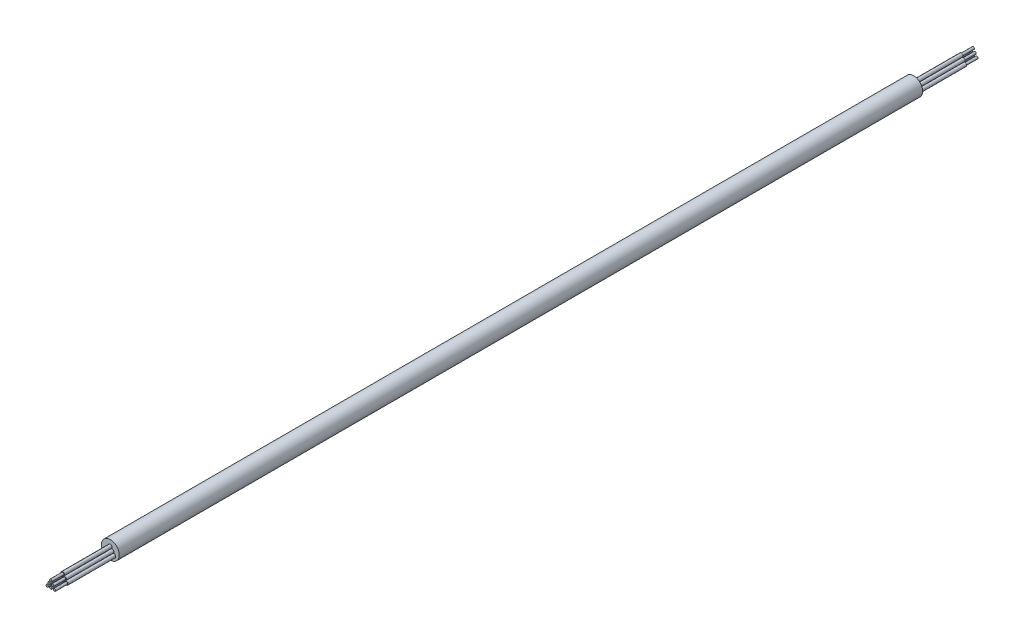
ISO-10303-21;
HEADER;
FILE_DESCRIPTION(('STEP AP214'),'2;1');
FILE_NAME('part.step','',(''),(''),'','','');
FILE_SCHEMA(('AUTOMOTIVE_DESIGN { 1 0 10303 214 1 1 1 1 }'));
ENDSEC;
DATA;
#1=APPLICATION_CONTEXT('core data for automotive mechanical design processes');
#2=APPLICATION_PROTOCOL_DEFINITION('international standard','automotive_design',2000,#1);
#3=PRODUCT_CONTEXT('',#1,'mechanical');
#4=PRODUCT('Part','Part','',(#3));
#5=PRODUCT_RELATED_PRODUCT_CATEGORY('part','',(#4));
#6=PRODUCT_DEFINITION_FORMATION('','',#4);
#7=PRODUCT_DEFINITION_CONTEXT('part definition',#1,'design');
#8=PRODUCT_DEFINITION('design','',#6,#7);
#9=PRODUCT_DEFINITION_SHAPE('','',#8);
#10=(LENGTH_UNIT() NAMED_UNIT(*) SI_UNIT(.MILLI.,.METRE.));
#11=(NAMED_UNIT(*) PLANE_ANGLE_UNIT() SI_UNIT($,.RADIAN.));
#12=(NAMED_UNIT(*) SI_UNIT($,.STERADIAN.) SOLID_ANGLE_UNIT());
#13=UNCERTAINTY_MEASURE_WITH_UNIT(LENGTH_MEASURE(1.E-05),#10,'distance_accuracy_value','');
#14=(GEOMETRIC_REPRESENTATION_CONTEXT(3) GLOBAL_UNCERTAINTY_ASSIGNED_CONTEXT((#13)) GLOBAL_UNIT_ASSIGNED_CONTEXT((#10,
#11,#12)) REPRESENTATION_CONTEXT('',''));
#15=CARTESIAN_POINT('',(0.,0.,0.));
#16=DIRECTION('',(0.,0.,1.));
#17=DIRECTION('',(1.,0.,0.));
#18=AXIS2_PLACEMENT_3D('',#15,#16,#17);
#19=CARTESIAN_POINT('',(-0.31,0.,-8.));
#20=DIRECTION('',(0.,0.,1.));
#21=DIRECTION('',(1.,0.,0.));
#22=AXIS2_PLACEMENT_3D('',#19,#20,#21);
#23=CYLINDRICAL_SURFACE('',#22,0.3);
#24=CARTESIAN_POINT('',(-0.31,0.,135.));
#25=DIRECTION('',(0.,0.,1.));
#26=DIRECTION('',(1.,0.,0.));
#27=AXIS2_PLACEMENT_3D('',#24,#25,#26);
#28=CIRCLE('',#27,0.3);
#29=CARTESIAN_POINT('',(-0.01,0.,135.));
#30=VERTEX_POINT('',#29);
#31=EDGE_CURVE('E206',#30,#30,#28,.F.);
#32=ORIENTED_EDGE('',*,*,#31,.F.);
#33=EDGE_LOOP('',(#32));
#34=FACE_BOUND('',#33,.T.);
#35=CARTESIAN_POINT('',(-0.31,0.,143.));
#36=DIRECTION('',(0.,0.,1.));
#37=DIRECTION('',(1.,0.,0.));
#38=AXIS2_PLACEMENT_3D('',#35,#36,#37);
#39=CIRCLE('',#38,0.3);
#40=CARTESIAN_POINT('',(-0.01,0.,143.));
#41=VERTEX_POINT('',#40);
#42=EDGE_CURVE('E217',#41,#41,#39,.T.);
#43=ORIENTED_EDGE('',*,*,#42,.F.);
#44=EDGE_LOOP('',(#43));
#45=FACE_BOUND('',#44,.T.);
#46=ADVANCED_FACE('F103',(#34,#45),#23,.T.);
#47=CARTESIAN_POINT('',(-0.31,0.,143.));
#48=DIRECTION('',(0.,0.,1.));
#49=DIRECTION('',(1.,0.,0.));
#50=AXIS2_PLACEMENT_3D('',#47,#48,#49);
#51=PLANE('',#50);
#52=CARTESIAN_POINT('',(-0.31,0.,143.));
#53=DIRECTION('',(0.,0.,1.));
#54=DIRECTION('',(1.,0.,0.));
#55=AXIS2_PLACEMENT_3D('',#52,#53,#54);
#56=CIRCLE('',#55,0.2);
#57=CARTESIAN_POINT('',(-0.11,0.,143.));
#58=VERTEX_POINT('',#57);
#59=EDGE_CURVE('E227',#58,#58,#56,.F.);
#60=ORIENTED_EDGE('',*,*,#59,.T.);
#61=EDGE_LOOP('',(#60));
#62=FACE_BOUND('',#61,.T.);
#63=ORIENTED_EDGE('',*,*,#42,.T.);
#64=EDGE_LOOP('',(#63));
#65=FACE_BOUND('',#64,.T.);
#66=ADVANCED_FACE('F264',(#62,#65),#51,.T.);
#67=CARTESIAN_POINT('',(0.,0.,145.));
#68=DIRECTION('',(0.,0.,1.));
#69=DIRECTION('',(1.,0.,0.));
#70=AXIS2_PLACEMENT_3D('',#67,#68,#69);
#71=PLANE('',#70);
#72=CARTESIAN_POINT('',(-0.31,0.,145.));
#73=DIRECTION('',(0.,0.,1.));
#74=DIRECTION('',(1.,0.,0.));
#75=AXIS2_PLACEMENT_3D('',#72,#73,#74);
#76=CIRCLE('',#75,0.2);
#77=CARTESIAN_POINT('',(-0.11,0.,145.));
#78=VERTEX_POINT('',#77);
#79=EDGE_CURVE('E221',#78,#78,#76,.T.);
#80=ORIENTED_EDGE('',*,*,#79,.T.);
#81=EDGE_LOOP('',(#80));
#82=FACE_BOUND('',#81,.T.);
#83=ADVANCED_FACE('F271',(#82),#71,.T.);
#84=CARTESIAN_POINT('',(-0.31,0.,-10.));
#85=DIRECTION('',(0.,0.,1.));
#86=DIRECTION('',(1.,0.,0.));
#87=AXIS2_PLACEMENT_3D('',#84,#85,#86);
#88=CYLINDRICAL_SURFACE('',#87,0.2);
#89=ORIENTED_EDGE('',*,*,#59,.F.);
#90=EDGE_LOOP('',(#89));
#91=FACE_BOUND('',#90,.T.);
#92=ORIENTED_EDGE('',*,*,#79,.F.);
#93=EDGE_LOOP('',(#92));
#94=FACE_BOUND('',#93,.T.);
#95=ADVANCED_FACE('F105',(#91,#94),#88,.T.);
#96=CARTESIAN_POINT('',(0.,0.,135.));
#97=DIRECTION('',(0.,0.,-1.));
#98=DIRECTION('',(-1.,0.,0.));
#99=AXIS2_PLACEMENT_3D('',#96,#97,#98);
#100=CYLINDRICAL_SURFACE('',#99,1.5);
#101=CARTESIAN_POINT('',(0.,0.,135.));
#102=DIRECTION('',(0.,0.,1.));
#103=DIRECTION('',(1.,0.,0.));
#104=AXIS2_PLACEMENT_3D('',#101,#102,#103);
#105=CIRCLE('',#104,1.5);
#106=CARTESIAN_POINT('',(1.5,0.,135.));
#107=VERTEX_POINT('',#106);
#108=EDGE_CURVE('E207',#107,#107,#105,.T.);
#109=ORIENTED_EDGE('',*,*,#108,.F.);
#110=EDGE_LOOP('',(#109));
#111=FACE_BOUND('',#110,.T.);
#112=CARTESIAN_POINT('',(0.,0.,0.));
#113=DIRECTION('',(0.,0.,1.));
#114=DIRECTION('',(1.,0.,0.));
#115=AXIS2_PLACEMENT_3D('',#112,#113,#114);
#116=CIRCLE('',#115,1.5);
#117=CARTESIAN_POINT('',(1.5,0.,0.));
#118=VERTEX_POINT('',#117);
#119=EDGE_CURVE('E211',#118,#118,#116,.T.);
#120=ORIENTED_EDGE('',*,*,#119,.T.);
#121=EDGE_LOOP('',(#120));
#122=FACE_BOUND('',#121,.T.);
#123=ADVANCED_FACE('F303',(#111,#122),#100,.T.);
#124=CARTESIAN_POINT('',(0.,0.,135.));
#125=DIRECTION('',(0.,0.,1.));
#126=DIRECTION('',(1.,0.,0.));
#127=AXIS2_PLACEMENT_3D('',#124,#125,#126);
#128=PLANE('',#127);
#129=CARTESIAN_POINT('',(0.61,-0.53,135.));
#130=DIRECTION('',(0.,0.,1.));
#131=DIRECTION('',(1.,0.,0.));
#132=AXIS2_PLACEMENT_3D('',#129,#130,#131);
#133=CIRCLE('',#132,0.3);
#134=CARTESIAN_POINT('',(0.91,-0.53,135.));
#135=VERTEX_POINT('',#134);
#136=EDGE_CURVE('E11',#135,#135,#133,.T.);
#137=ORIENTED_EDGE('',*,*,#136,.F.);
#138=EDGE_LOOP('',(#137));
#139=FACE_BOUND('',#138,.T.);
#140=CARTESIAN_POINT('',(-0.61,-0.53,135.));
#141=DIRECTION('',(0.,0.,1.));
#142=DIRECTION('',(1.,0.,0.));
#143=AXIS2_PLACEMENT_3D('',#140,#141,#142);
#144=CIRCLE('',#143,0.3);
#145=CARTESIAN_POINT('',(-0.31,-0.53,135.));
#146=VERTEX_POINT('',#145);
#147=EDGE_CURVE('E111',#146,#146,#144,.T.);
#148=ORIENTED_EDGE('',*,*,#147,.F.);
#149=EDGE_LOOP('',(#148));
#150=FACE_BOUND('',#149,.T.);
#151=CARTESIAN_POINT('',(0.,-0.53,135.));
#152=DIRECTION('',(0.,0.,1.));
#153=DIRECTION('',(1.,0.,0.));
#154=AXIS2_PLACEMENT_3D('',#151,#152,#153);
#155=CIRCLE('',#154,0.3);
#156=CARTESIAN_POINT('',(0.3,-0.53,135.));
#157=VERTEX_POINT('',#156);
#158=EDGE_CURVE('E116',#157,#157,#155,.T.);
#159=ORIENTED_EDGE('',*,*,#158,.F.);
#160=EDGE_LOOP('',(#159));
#161=FACE_BOUND('',#160,.T.);
#162=CARTESIAN_POINT('',(0.31,0.,135.));
#163=DIRECTION('',(0.,0.,1.));
#164=DIRECTION('',(1.,0.,0.));
#165=AXIS2_PLACEMENT_3D('',#162,#163,#164);
#166=CIRCLE('',#165,0.3);
#167=CARTESIAN_POINT('',(0.61,0.,135.));
#168=VERTEX_POINT('',#167);
#169=EDGE_CURVE('E162',#168,#168,#166,.T.);
#170=ORIENTED_EDGE('',*,*,#169,.F.);
#171=EDGE_LOOP('',(#170));
#172=FACE_BOUND('',#171,.T.);
#173=CARTESIAN_POINT('',(0.,0.53,135.));
#174=DIRECTION('',(0.,0.,1.));
#175=DIRECTION('',(1.,0.,0.));
#176=AXIS2_PLACEMENT_3D('',#173,#174,#175);
#177=CIRCLE('',#176,0.3);
#178=CARTESIAN_POINT('',(0.3,0.53,135.));
#179=VERTEX_POINT('',#178);
#180=EDGE_CURVE('E184',#179,#179,#177,.T.);
#181=ORIENTED_EDGE('',*,*,#180,.F.);
#182=EDGE_LOOP('',(#181));
#183=FACE_BOUND('',#182,.T.);
#184=ORIENTED_EDGE('',*,*,#31,.T.);
#185=EDGE_LOOP('',(#184));
#186=FACE_BOUND('',#185,.T.);
#187=ORIENTED_EDGE('',*,*,#108,.T.);
#188=EDGE_LOOP('',(#187));
#189=FACE_BOUND('',#188,.T.);
#190=ADVANCED_FACE('F298',(#139,#150,#161,#172,#183,#186,#189),#128,.T.);
#191=CARTESIAN_POINT('',(0.,0.,0.));
#192=DIRECTION('',(0.,0.,1.));
#193=DIRECTION('',(1.,0.,0.));
#194=AXIS2_PLACEMENT_3D('',#191,#192,#193);
#195=PLANE('',#194);
#196=CARTESIAN_POINT('',(0.61,-0.53,0.));
#197=DIRECTION('',(0.,0.,1.));
#198=DIRECTION('',(1.,0.,0.));
#199=AXIS2_PLACEMENT_3D('',#196,#197,#198);
#200=CIRCLE('',#199,0.3);
#201=CARTESIAN_POINT('',(0.91,-0.53,0.));
#202=VERTEX_POINT('',#201);
#203=EDGE_CURVE('E107',#202,#202,#200,.T.);
#204=ORIENTED_EDGE('',*,*,#203,.T.);
#205=EDGE_LOOP('',(#204));
#206=FACE_BOUND('',#205,.T.);
#207=CARTESIAN_POINT('',(-0.61,-0.53,0.));
#208=DIRECTION('',(0.,0.,1.));
#209=DIRECTION('',(1.,0.,0.));
#210=AXIS2_PLACEMENT_3D('',#207,#208,#209);
#211=CIRCLE('',#210,0.3);
#212=CARTESIAN_POINT('',(-0.31,-0.53,0.));
#213=VERTEX_POINT('',#212);
#214=EDGE_CURVE('E138',#213,#213,#211,.T.);
#215=ORIENTED_EDGE('',*,*,#214,.T.);
#216=EDGE_LOOP('',(#215));
#217=FACE_BOUND('',#216,.T.);
#218=CARTESIAN_POINT('',(0.,-0.53,0.));
#219=DIRECTION('',(0.,0.,1.));
#220=DIRECTION('',(1.,0.,0.));
#221=AXIS2_PLACEMENT_3D('',#218,#219,#220);
#222=CIRCLE('',#221,0.3);
#223=CARTESIAN_POINT('',(0.3,-0.53,0.));
#224=VERTEX_POINT('',#223);
#225=EDGE_CURVE('E157',#224,#224,#222,.T.);
#226=ORIENTED_EDGE('',*,*,#225,.T.);
#227=EDGE_LOOP('',(#226));
#228=FACE_BOUND('',#227,.T.);
#229=CARTESIAN_POINT('',(0.31,0.,0.));
#230=DIRECTION('',(0.,0.,1.));
#231=DIRECTION('',(1.,0.,0.));
#232=AXIS2_PLACEMENT_3D('',#229,#230,#231);
#233=CIRCLE('',#232,0.3);
#234=CARTESIAN_POINT('',(0.61,0.,0.));
#235=VERTEX_POINT('',#234);
#236=EDGE_CURVE('E179',#235,#235,#233,.T.);
#237=ORIENTED_EDGE('',*,*,#236,.T.);
#238=EDGE_LOOP('',(#237));
#239=FACE_BOUND('',#238,.T.);
#240=CARTESIAN_POINT('',(0.,0.53,0.));
#241=DIRECTION('',(0.,0.,1.));
#242=DIRECTION('',(1.,0.,0.));
#243=AXIS2_PLACEMENT_3D('',#240,#241,#242);
#244=CIRCLE('',#243,0.3);
#245=CARTESIAN_POINT('',(0.3,0.53,0.));
#246=VERTEX_POINT('',#245);
#247=EDGE_CURVE('E201',#246,#246,#244,.T.);
#248=ORIENTED_EDGE('',*,*,#247,.T.);
#249=EDGE_LOOP('',(#248));
#250=FACE_BOUND('',#249,.T.);
#251=CARTESIAN_POINT('',(-0.31,0.,0.));
#252=DIRECTION('',(0.,0.,1.));
#253=DIRECTION('',(1.,0.,0.));
#254=AXIS2_PLACEMENT_3D('',#251,#252,#253);
#255=CIRCLE('',#254,0.3);
#256=CARTESIAN_POINT('',(-0.01,0.,0.));
#257=VERTEX_POINT('',#256);
#258=EDGE_CURVE('E210',#257,#257,#255,.F.);
#259=ORIENTED_EDGE('',*,*,#258,.F.);
#260=EDGE_LOOP('',(#259));
#261=FACE_BOUND('',#260,.T.);
#262=ORIENTED_EDGE('',*,*,#119,.F.);
#263=EDGE_LOOP('',(#262));
#264=FACE_BOUND('',#263,.T.);
#265=ADVANCED_FACE('F244',(#206,#217,#228,#239,#250,#261,#264),#195,.F.);
#266=CARTESIAN_POINT('',(0.,0.,-10.));
#267=DIRECTION('',(0.,0.,1.));
#268=DIRECTION('',(1.,0.,0.));
#269=AXIS2_PLACEMENT_3D('',#266,#267,#268);
#270=PLANE('',#269);
#271=CARTESIAN_POINT('',(-0.31,0.,-10.));
#272=DIRECTION('',(0.,0.,1.));
#273=DIRECTION('',(1.,0.,0.));
#274=AXIS2_PLACEMENT_3D('',#271,#272,#273);
#275=CIRCLE('',#274,0.2);
#276=CARTESIAN_POINT('',(-0.11,0.,-10.));
#277=VERTEX_POINT('',#276);
#278=EDGE_CURVE('E224',#277,#277,#275,.T.);
#279=ORIENTED_EDGE('',*,*,#278,.F.);
#280=EDGE_LOOP('',(#279));
#281=FACE_BOUND('',#280,.T.);
#282=ADVANCED_FACE('F297',(#281),#270,.F.);
#283=ORIENTED_EDGE('',*,*,#278,.T.);
#284=EDGE_LOOP('',(#283));
#285=FACE_BOUND('',#284,.T.);
#286=CARTESIAN_POINT('',(-0.31,0.,-8.));
#287=DIRECTION('',(0.,0.,1.));
#288=DIRECTION('',(1.,0.,0.));
#289=AXIS2_PLACEMENT_3D('',#286,#287,#288);
#290=CIRCLE('',#289,0.2);
#291=CARTESIAN_POINT('',(-0.11,0.,-8.));
#292=VERTEX_POINT('',#291);
#293=EDGE_CURVE('E220',#292,#292,#290,.F.);
#294=ORIENTED_EDGE('',*,*,#293,.T.);
#295=EDGE_LOOP('',(#294));
#296=FACE_BOUND('',#295,.T.);
#297=ADVANCED_FACE('F289',(#285,#296),#88,.T.);
#298=CARTESIAN_POINT('',(-0.31,0.,-8.));
#299=DIRECTION('',(0.,0.,1.));
#300=DIRECTION('',(1.,0.,0.));
#301=AXIS2_PLACEMENT_3D('',#298,#299,#300);
#302=PLANE('',#301);
#303=ORIENTED_EDGE('',*,*,#293,.F.);
#304=EDGE_LOOP('',(#303));
#305=FACE_BOUND('',#304,.T.);
#306=CARTESIAN_POINT('',(-0.31,0.,-8.));
#307=DIRECTION('',(0.,0.,1.));
#308=DIRECTION('',(1.,0.,0.));
#309=AXIS2_PLACEMENT_3D('',#306,#307,#308);
#310=CIRCLE('',#309,0.3);
#311=CARTESIAN_POINT('',(-0.01,0.,-8.));
#312=VERTEX_POINT('',#311);
#313=EDGE_CURVE('E214',#312,#312,#310,.T.);
#314=ORIENTED_EDGE('',*,*,#313,.F.);
#315=EDGE_LOOP('',(#314));
#316=FACE_BOUND('',#315,.T.);
#317=ADVANCED_FACE('F280',(#305,#316),#302,.F.);
#318=ORIENTED_EDGE('',*,*,#313,.T.);
#319=EDGE_LOOP('',(#318));
#320=FACE_BOUND('',#319,.T.);
#321=ORIENTED_EDGE('',*,*,#258,.T.);
#322=EDGE_LOOP('',(#321));
#323=FACE_BOUND('',#322,.T.);
#324=ADVANCED_FACE('F267',(#320,#323),#23,.T.);
#325=CARTESIAN_POINT('',(0.,0.,-10.));
#326=DIRECTION('',(0.,0.,1.));
#327=DIRECTION('',(1.,0.,0.));
#328=AXIS2_PLACEMENT_3D('',#325,#326,#327);
#329=PLANE('',#328);
#330=CARTESIAN_POINT('',(0.,0.53,-10.));
#331=DIRECTION('',(0.,0.,1.));
#332=DIRECTION('',(1.,0.,0.));
#333=AXIS2_PLACEMENT_3D('',#330,#331,#332);
#334=CIRCLE('',#333,0.2);
#335=CARTESIAN_POINT('',(0.2,0.53,-10.));
#336=VERTEX_POINT('',#335);
#337=EDGE_CURVE('E195',#336,#336,#334,.T.);
#338=ORIENTED_EDGE('',*,*,#337,.F.);
#339=EDGE_LOOP('',(#338));
#340=FACE_BOUND('',#339,.T.);
#341=ADVANCED_FACE('F279',(#340),#329,.F.);
#342=CARTESIAN_POINT('',(0.,0.53,-10.));
#343=DIRECTION('',(0.,0.,1.));
#344=DIRECTION('',(1.,0.,0.));
#345=AXIS2_PLACEMENT_3D('',#342,#343,#344);
#346=CYLINDRICAL_SURFACE('',#345,0.2);
#347=ORIENTED_EDGE('',*,*,#337,.T.);
#348=EDGE_LOOP('',(#347));
#349=FACE_BOUND('',#348,.T.);
#350=CARTESIAN_POINT('',(0.,0.53,-8.));
#351=DIRECTION('',(0.,0.,1.));
#352=DIRECTION('',(1.,0.,0.));
#353=AXIS2_PLACEMENT_3D('',#350,#351,#352);
#354=CIRCLE('',#353,0.2);
#355=CARTESIAN_POINT('',(0.2,0.53,-8.));
#356=VERTEX_POINT('',#355);
#357=EDGE_CURVE('E191',#356,#356,#354,.F.);
#358=ORIENTED_EDGE('',*,*,#357,.T.);
#359=EDGE_LOOP('',(#358));
#360=FACE_BOUND('',#359,.T.);
#361=ADVANCED_FACE('F286',(#349,#360),#346,.T.);
#362=CARTESIAN_POINT('',(0.,0.53,-8.));
#363=DIRECTION('',(0.,0.,1.));
#364=DIRECTION('',(1.,0.,0.));
#365=AXIS2_PLACEMENT_3D('',#362,#363,#364);
#366=PLANE('',#365);
#367=ORIENTED_EDGE('',*,*,#357,.F.);
#368=EDGE_LOOP('',(#367));
#369=FACE_BOUND('',#368,.T.);
#370=CARTESIAN_POINT('',(0.,0.53,-8.));
#371=DIRECTION('',(0.,0.,1.));
#372=DIRECTION('',(1.,0.,0.));
#373=AXIS2_PLACEMENT_3D('',#370,#371,#372);
#374=CIRCLE('',#373,0.3);
#375=CARTESIAN_POINT('',(0.3,0.53,-8.));
#376=VERTEX_POINT('',#375);
#377=EDGE_CURVE('E188',#376,#376,#374,.T.);
#378=ORIENTED_EDGE('',*,*,#377,.F.);
#379=EDGE_LOOP('',(#378));
#380=FACE_BOUND('',#379,.T.);
#381=ADVANCED_FACE('F330',(#369,#380),#366,.F.);
#382=CARTESIAN_POINT('',(0.,0.53,-8.));
#383=DIRECTION('',(0.,0.,1.));
#384=DIRECTION('',(1.,0.,0.));
#385=AXIS2_PLACEMENT_3D('',#382,#383,#384);
#386=CYLINDRICAL_SURFACE('',#385,0.3);
#387=ORIENTED_EDGE('',*,*,#377,.T.);
#388=EDGE_LOOP('',(#387));
#389=FACE_BOUND('',#388,.T.);
#390=ORIENTED_EDGE('',*,*,#247,.F.);
#391=EDGE_LOOP('',(#390));
#392=FACE_BOUND('',#391,.T.);
#393=ADVANCED_FACE('F328',(#389,#392),#386,.T.);
#394=ORIENTED_EDGE('',*,*,#180,.T.);
#395=EDGE_LOOP('',(#394));
#396=FACE_BOUND('',#395,.T.);
#397=CARTESIAN_POINT('',(0.,0.53,143.));
#398=DIRECTION('',(0.,0.,1.));
#399=DIRECTION('',(1.,0.,0.));
#400=AXIS2_PLACEMENT_3D('',#397,#398,#399);
#401=CIRCLE('',#400,0.3);
#402=CARTESIAN_POINT('',(0.3,0.53,143.));
#403=VERTEX_POINT('',#402);
#404=EDGE_CURVE('E185',#403,#403,#401,.T.);
#405=ORIENTED_EDGE('',*,*,#404,.F.);
#406=EDGE_LOOP('',(#405));
#407=FACE_BOUND('',#406,.T.);
#408=ADVANCED_FACE('F325',(#396,#407),#386,.T.);
#409=CARTESIAN_POINT('',(0.,0.53,143.));
#410=DIRECTION('',(0.,0.,1.));
#411=DIRECTION('',(1.,0.,0.));
#412=AXIS2_PLACEMENT_3D('',#409,#410,#411);
#413=PLANE('',#412);
#414=CARTESIAN_POINT('',(0.,0.53,143.));
#415=DIRECTION('',(0.,0.,1.));
#416=DIRECTION('',(1.,0.,0.));
#417=AXIS2_PLACEMENT_3D('',#414,#415,#416);
#418=CIRCLE('',#417,0.2);
#419=CARTESIAN_POINT('',(0.2,0.53,143.));
#420=VERTEX_POINT('',#419);
#421=EDGE_CURVE('E198',#420,#420,#418,.F.);
#422=ORIENTED_EDGE('',*,*,#421,.T.);
#423=EDGE_LOOP('',(#422));
#424=FACE_BOUND('',#423,.T.);
#425=ORIENTED_EDGE('',*,*,#404,.T.);
#426=EDGE_LOOP('',(#425));
#427=FACE_BOUND('',#426,.T.);
#428=ADVANCED_FACE('F323',(#424,#427),#413,.T.);
#429=CARTESIAN_POINT('',(0.,0.,145.));
#430=DIRECTION('',(0.,0.,1.));
#431=DIRECTION('',(1.,0.,0.));
#432=AXIS2_PLACEMENT_3D('',#429,#430,#431);
#433=PLANE('',#432);
#434=CARTESIAN_POINT('',(0.,0.53,145.));
#435=DIRECTION('',(0.,0.,1.));
#436=DIRECTION('',(1.,0.,0.));
#437=AXIS2_PLACEMENT_3D('',#434,#435,#436);
#438=CIRCLE('',#437,0.2);
#439=CARTESIAN_POINT('',(0.2,0.53,145.));
#440=VERTEX_POINT('',#439);
#441=EDGE_CURVE('E192',#440,#440,#438,.T.);
#442=ORIENTED_EDGE('',*,*,#441,.T.);
#443=EDGE_LOOP('',(#442));
#444=FACE_BOUND('',#443,.T.);
#445=ADVANCED_FACE('F318',(#444),#433,.T.);
#446=ORIENTED_EDGE('',*,*,#421,.F.);
#447=EDGE_LOOP('',(#446));
#448=FACE_BOUND('',#447,.T.);
#449=ORIENTED_EDGE('',*,*,#441,.F.);
#450=EDGE_LOOP('',(#449));
#451=FACE_BOUND('',#450,.T.);
#452=ADVANCED_FACE('F315',(#448,#451),#346,.T.);
#453=CARTESIAN_POINT('',(0.,0.,-10.));
#454=DIRECTION('',(0.,0.,1.));
#455=DIRECTION('',(1.,0.,0.));
#456=AXIS2_PLACEMENT_3D('',#453,#454,#455);
#457=PLANE('',#456);
#458=CARTESIAN_POINT('',(0.31,0.,-10.));
#459=DIRECTION('',(0.,0.,1.));
#460=DIRECTION('',(1.,0.,0.));
#461=AXIS2_PLACEMENT_3D('',#458,#459,#460);
#462=CIRCLE('',#461,0.2);
#463=CARTESIAN_POINT('',(0.51,0.,-10.));
#464=VERTEX_POINT('',#463);
#465=EDGE_CURVE('E173',#464,#464,#462,.T.);
#466=ORIENTED_EDGE('',*,*,#465,.F.);
#467=EDGE_LOOP('',(#466));
#468=FACE_BOUND('',#467,.T.);
#469=ADVANCED_FACE('F317',(#468),#457,.F.);
#470=CARTESIAN_POINT('',(0.31,0.,-10.));
#471=DIRECTION('',(0.,0.,1.));
#472=DIRECTION('',(1.,0.,0.));
#473=AXIS2_PLACEMENT_3D('',#470,#471,#472);
#474=CYLINDRICAL_SURFACE('',#473,0.2);
#475=ORIENTED_EDGE('',*,*,#465,.T.);
#476=EDGE_LOOP('',(#475));
#477=FACE_BOUND('',#476,.T.);
#478=CARTESIAN_POINT('',(0.31,0.,-8.));
#479=DIRECTION('',(0.,0.,1.));
#480=DIRECTION('',(1.,0.,0.));
#481=AXIS2_PLACEMENT_3D('',#478,#479,#480);
#482=CIRCLE('',#481,0.2);
#483=CARTESIAN_POINT('',(0.51,0.,-8.));
#484=VERTEX_POINT('',#483);
#485=EDGE_CURVE('E169',#484,#484,#482,.F.);
#486=ORIENTED_EDGE('',*,*,#485,.T.);
#487=EDGE_LOOP('',(#486));
#488=FACE_BOUND('',#487,.T.);
#489=ADVANCED_FACE('F343',(#477,#488),#474,.T.);
#490=CARTESIAN_POINT('',(0.31,0.,-8.));
#491=DIRECTION('',(0.,0.,1.));
#492=DIRECTION('',(1.,0.,0.));
#493=AXIS2_PLACEMENT_3D('',#490,#491,#492);
#494=PLANE('',#493);
#495=ORIENTED_EDGE('',*,*,#485,.F.);
#496=EDGE_LOOP('',(#495));
#497=FACE_BOUND('',#496,.T.);
#498=CARTESIAN_POINT('',(0.31,0.,-8.));
#499=DIRECTION('',(0.,0.,1.));
#500=DIRECTION('',(1.,0.,0.));
#501=AXIS2_PLACEMENT_3D('',#498,#499,#500);
#502=CIRCLE('',#501,0.3);
#503=CARTESIAN_POINT('',(0.61,0.,-8.));
#504=VERTEX_POINT('',#503);
#505=EDGE_CURVE('E163',#504,#504,#502,.T.);
#506=ORIENTED_EDGE('',*,*,#505,.F.);
#507=EDGE_LOOP('',(#506));
#508=FACE_BOUND('',#507,.T.);
#509=ADVANCED_FACE('F355',(#497,#508),#494,.F.);
#510=CARTESIAN_POINT('',(0.31,0.,-8.));
#511=DIRECTION('',(0.,0.,1.));
#512=DIRECTION('',(1.,0.,0.));
#513=AXIS2_PLACEMENT_3D('',#510,#511,#512);
#514=CYLINDRICAL_SURFACE('',#513,0.3);
#515=ORIENTED_EDGE('',*,*,#505,.T.);
#516=EDGE_LOOP('',(#515));
#517=FACE_BOUND('',#516,.T.);
#518=ORIENTED_EDGE('',*,*,#236,.F.);
#519=EDGE_LOOP('',(#518));
#520=FACE_BOUND('',#519,.T.);
#521=ADVANCED_FACE('F358',(#517,#520),#514,.T.);
#522=ORIENTED_EDGE('',*,*,#169,.T.);
#523=EDGE_LOOP('',(#522));
#524=FACE_BOUND('',#523,.T.);
#525=CARTESIAN_POINT('',(0.31,0.,143.));
#526=DIRECTION('',(0.,0.,1.));
#527=DIRECTION('',(1.,0.,0.));
#528=AXIS2_PLACEMENT_3D('',#525,#526,#527);
#529=CIRCLE('',#528,0.3);
#530=CARTESIAN_POINT('',(0.61,0.,143.));
#531=VERTEX_POINT('',#530);
#532=EDGE_CURVE('E166',#531,#531,#529,.T.);
#533=ORIENTED_EDGE('',*,*,#532,.F.);
#534=EDGE_LOOP('',(#533));
#535=FACE_BOUND('',#534,.T.);
#536=ADVANCED_FACE('F353',(#524,#535),#514,.T.);
#537=CARTESIAN_POINT('',(0.31,0.,143.));
#538=DIRECTION('',(0.,0.,1.));
#539=DIRECTION('',(1.,0.,0.));
#540=AXIS2_PLACEMENT_3D('',#537,#538,#539);
#541=PLANE('',#540);
#542=CARTESIAN_POINT('',(0.31,0.,143.));
#543=DIRECTION('',(0.,0.,1.));
#544=DIRECTION('',(1.,0.,0.));
#545=AXIS2_PLACEMENT_3D('',#542,#543,#544);
#546=CIRCLE('',#545,0.2);
#547=CARTESIAN_POINT('',(0.51,0.,143.));
#548=VERTEX_POINT('',#547);
#549=EDGE_CURVE('E176',#548,#548,#546,.F.);
#550=ORIENTED_EDGE('',*,*,#549,.T.);
#551=EDGE_LOOP('',(#550));
#552=FACE_BOUND('',#551,.T.);
#553=ORIENTED_EDGE('',*,*,#532,.T.);
#554=EDGE_LOOP('',(#553));
#555=FACE_BOUND('',#554,.T.);
#556=ADVANCED_FACE('F349',(#552,#555),#541,.T.);
#557=CARTESIAN_POINT('',(0.,0.,145.));
#558=DIRECTION('',(0.,0.,1.));
#559=DIRECTION('',(1.,0.,0.));
#560=AXIS2_PLACEMENT_3D('',#557,#558,#559);
#561=PLANE('',#560);
#562=CARTESIAN_POINT('',(0.31,0.,145.));
#563=DIRECTION('',(0.,0.,1.));
#564=DIRECTION('',(1.,0.,0.));
#565=AXIS2_PLACEMENT_3D('',#562,#563,#564);
#566=CIRCLE('',#565,0.2);
#567=CARTESIAN_POINT('',(0.51,0.,145.));
#568=VERTEX_POINT('',#567);
#569=EDGE_CURVE('E170',#568,#568,#566,.T.);
#570=ORIENTED_EDGE('',*,*,#569,.T.);
#571=EDGE_LOOP('',(#570));
#572=FACE_BOUND('',#571,.T.);
#573=ADVANCED_FACE('F341',(#572),#561,.T.);
#574=ORIENTED_EDGE('',*,*,#549,.F.);
#575=EDGE_LOOP('',(#574));
#576=FACE_BOUND('',#575,.T.);
#577=ORIENTED_EDGE('',*,*,#569,.F.);
#578=EDGE_LOOP('',(#577));
#579=FACE_BOUND('',#578,.T.);
#580=ADVANCED_FACE('F337',(#576,#579),#474,.T.);
#581=CARTESIAN_POINT('',(0.,0.,-10.));
#582=DIRECTION('',(0.,0.,1.));
#583=DIRECTION('',(1.,0.,0.));
#584=AXIS2_PLACEMENT_3D('',#581,#582,#583);
#585=PLANE('',#584);
#586=CARTESIAN_POINT('',(0.,-0.53,-10.));
#587=DIRECTION('',(0.,0.,1.));
#588=DIRECTION('',(1.,0.,0.));
#589=AXIS2_PLACEMENT_3D('',#586,#587,#588);
#590=CIRCLE('',#589,0.2);
#591=CARTESIAN_POINT('',(0.2,-0.53,-10.));
#592=VERTEX_POINT('',#591);
#593=EDGE_CURVE('E151',#592,#592,#590,.T.);
#594=ORIENTED_EDGE('',*,*,#593,.F.);
#595=EDGE_LOOP('',(#594));
#596=FACE_BOUND('',#595,.T.);
#597=ADVANCED_FACE('F340',(#596),#585,.F.);
#598=CARTESIAN_POINT('',(0.,-0.53,-10.));
#599=DIRECTION('',(0.,0.,1.));
#600=DIRECTION('',(1.,0.,0.));
#601=AXIS2_PLACEMENT_3D('',#598,#599,#600);
#602=CYLINDRICAL_SURFACE('',#601,0.2);
#603=ORIENTED_EDGE('',*,*,#593,.T.);
#604=EDGE_LOOP('',(#603));
#605=FACE_BOUND('',#604,.T.);
#606=CARTESIAN_POINT('',(0.,-0.53,-8.));
#607=DIRECTION('',(0.,0.,1.));
#608=DIRECTION('',(1.,0.,0.));
#609=AXIS2_PLACEMENT_3D('',#606,#607,#608);
#610=CIRCLE('',#609,0.2);
#611=CARTESIAN_POINT('',(0.2,-0.53,-8.));
#612=VERTEX_POINT('',#611);
#613=EDGE_CURVE('E147',#612,#612,#610,.F.);
#614=ORIENTED_EDGE('',*,*,#613,.T.);
#615=EDGE_LOOP('',(#614));
#616=FACE_BOUND('',#615,.T.);
#617=ADVANCED_FACE('F369',(#605,#616),#602,.T.);
#618=CARTESIAN_POINT('',(0.,-0.53,-8.));
#619=DIRECTION('',(0.,0.,1.));
#620=DIRECTION('',(1.,0.,0.));
#621=AXIS2_PLACEMENT_3D('',#618,#619,#620);
#622=PLANE('',#621);
#623=ORIENTED_EDGE('',*,*,#613,.F.);
#624=EDGE_LOOP('',(#623));
#625=FACE_BOUND('',#624,.T.);
#626=CARTESIAN_POINT('',(0.,-0.53,-8.));
#627=DIRECTION('',(0.,0.,1.));
#628=DIRECTION('',(1.,0.,0.));
#629=AXIS2_PLACEMENT_3D('',#626,#627,#628);
#630=CIRCLE('',#629,0.3);
#631=CARTESIAN_POINT('',(0.3,-0.53,-8.));
#632=VERTEX_POINT('',#631);
#633=EDGE_CURVE('E141',#632,#632,#630,.T.);
#634=ORIENTED_EDGE('',*,*,#633,.F.);
#635=EDGE_LOOP('',(#634));
#636=FACE_BOUND('',#635,.T.);
#637=ADVANCED_FACE('F381',(#625,#636),#622,.F.);
#638=CARTESIAN_POINT('',(0.,-0.53,-8.));
#639=DIRECTION('',(0.,0.,1.));
#640=DIRECTION('',(1.,0.,0.));
#641=AXIS2_PLACEMENT_3D('',#638,#639,#640);
#642=CYLINDRICAL_SURFACE('',#641,0.3);
#643=ORIENTED_EDGE('',*,*,#633,.T.);
#644=EDGE_LOOP('',(#643));
#645=FACE_BOUND('',#644,.T.);
#646=ORIENTED_EDGE('',*,*,#225,.F.);
#647=EDGE_LOOP('',(#646));
#648=FACE_BOUND('',#647,.T.);
#649=ADVANCED_FACE('F384',(#645,#648),#642,.T.);
#650=ORIENTED_EDGE('',*,*,#158,.T.);
#651=EDGE_LOOP('',(#650));
#652=FACE_BOUND('',#651,.T.);
#653=CARTESIAN_POINT('',(0.,-0.53,143.));
#654=DIRECTION('',(0.,0.,1.));
#655=DIRECTION('',(1.,0.,0.));
#656=AXIS2_PLACEMENT_3D('',#653,#654,#655);
#657=CIRCLE('',#656,0.3);
#658=CARTESIAN_POINT('',(0.3,-0.53,143.));
#659=VERTEX_POINT('',#658);
#660=EDGE_CURVE('E144',#659,#659,#657,.T.);
#661=ORIENTED_EDGE('',*,*,#660,.F.);
#662=EDGE_LOOP('',(#661));
#663=FACE_BOUND('',#662,.T.);
#664=ADVANCED_FACE('F379',(#652,#663),#642,.T.);
#665=CARTESIAN_POINT('',(0.,-0.53,143.));
#666=DIRECTION('',(0.,0.,1.));
#667=DIRECTION('',(1.,0.,0.));
#668=AXIS2_PLACEMENT_3D('',#665,#666,#667);
#669=PLANE('',#668);
#670=CARTESIAN_POINT('',(0.,-0.53,143.));
#671=DIRECTION('',(0.,0.,1.));
#672=DIRECTION('',(1.,0.,0.));
#673=AXIS2_PLACEMENT_3D('',#670,#671,#672);
#674=CIRCLE('',#673,0.2);
#675=CARTESIAN_POINT('',(0.2,-0.53,143.));
#676=VERTEX_POINT('',#675);
#677=EDGE_CURVE('E154',#676,#676,#674,.F.);
#678=ORIENTED_EDGE('',*,*,#677,.T.);
#679=EDGE_LOOP('',(#678));
#680=FACE_BOUND('',#679,.T.);
#681=ORIENTED_EDGE('',*,*,#660,.T.);
#682=EDGE_LOOP('',(#681));
#683=FACE_BOUND('',#682,.T.);
#684=ADVANCED_FACE('F375',(#680,#683),#669,.T.);
#685=CARTESIAN_POINT('',(0.,0.,145.));
#686=DIRECTION('',(0.,0.,1.));
#687=DIRECTION('',(1.,0.,0.));
#688=AXIS2_PLACEMENT_3D('',#685,#686,#687);
#689=PLANE('',#688);
#690=CARTESIAN_POINT('',(0.,-0.53,145.));
#691=DIRECTION('',(0.,0.,1.));
#692=DIRECTION('',(1.,0.,0.));
#693=AXIS2_PLACEMENT_3D('',#690,#691,#692);
#694=CIRCLE('',#693,0.2);
#695=CARTESIAN_POINT('',(0.2,-0.53,145.));
#696=VERTEX_POINT('',#695);
#697=EDGE_CURVE('E148',#696,#696,#694,.T.);
#698=ORIENTED_EDGE('',*,*,#697,.T.);
#699=EDGE_LOOP('',(#698));
#700=FACE_BOUND('',#699,.T.);
#701=ADVANCED_FACE('F367',(#700),#689,.T.);
#702=ORIENTED_EDGE('',*,*,#677,.F.);
#703=EDGE_LOOP('',(#702));
#704=FACE_BOUND('',#703,.T.);
#705=ORIENTED_EDGE('',*,*,#697,.F.);
#706=EDGE_LOOP('',(#705));
#707=FACE_BOUND('',#706,.T.);
#708=ADVANCED_FACE('F363',(#704,#707),#602,.T.);
#709=CARTESIAN_POINT('',(0.,0.,-10.));
#710=DIRECTION('',(0.,0.,1.));
#711=DIRECTION('',(1.,0.,0.));
#712=AXIS2_PLACEMENT_3D('',#709,#710,#711);
#713=PLANE('',#712);
#714=CARTESIAN_POINT('',(-0.61,-0.53,-10.));
#715=DIRECTION('',(0.,0.,1.));
#716=DIRECTION('',(1.,0.,0.));
#717=AXIS2_PLACEMENT_3D('',#714,#715,#716);
#718=CIRCLE('',#717,0.2);
#719=CARTESIAN_POINT('',(-0.41,-0.53,-10.));
#720=VERTEX_POINT('',#719);
#721=EDGE_CURVE('E132',#720,#720,#718,.T.);
#722=ORIENTED_EDGE('',*,*,#721,.F.);
#723=EDGE_LOOP('',(#722));
#724=FACE_BOUND('',#723,.T.);
#725=ADVANCED_FACE('F366',(#724),#713,.F.);
#726=CARTESIAN_POINT('',(-0.61,-0.53,-10.));
#727=DIRECTION('',(0.,0.,1.));
#728=DIRECTION('',(1.,0.,0.));
#729=AXIS2_PLACEMENT_3D('',#726,#727,#728);
#730=CYLINDRICAL_SURFACE('',#729,0.2);
#731=ORIENTED_EDGE('',*,*,#721,.T.);
#732=EDGE_LOOP('',(#731));
#733=FACE_BOUND('',#732,.T.);
#734=CARTESIAN_POINT('',(-0.61,-0.53,-8.));
#735=DIRECTION('',(0.,0.,1.));
#736=DIRECTION('',(1.,0.,0.));
#737=AXIS2_PLACEMENT_3D('',#734,#735,#736);
#738=CIRCLE('',#737,0.2);
#739=CARTESIAN_POINT('',(-0.41,-0.53,-8.));
#740=VERTEX_POINT('',#739);
#741=EDGE_CURVE('E128',#740,#740,#738,.F.);
#742=ORIENTED_EDGE('',*,*,#741,.T.);
#743=EDGE_LOOP('',(#742));
#744=FACE_BOUND('',#743,.T.);
#745=ADVANCED_FACE('F259',(#733,#744),#730,.T.);
#746=CARTESIAN_POINT('',(-0.61,-0.53,-8.));
#747=DIRECTION('',(0.,0.,1.));
#748=DIRECTION('',(1.,0.,0.));
#749=AXIS2_PLACEMENT_3D('',#746,#747,#748);
#750=PLANE('',#749);
#751=ORIENTED_EDGE('',*,*,#741,.F.);
#752=EDGE_LOOP('',(#751));
#753=FACE_BOUND('',#752,.T.);
#754=CARTESIAN_POINT('',(-0.61,-0.53,-8.));
#755=DIRECTION('',(0.,0.,1.));
#756=DIRECTION('',(1.,0.,0.));
#757=AXIS2_PLACEMENT_3D('',#754,#755,#756);
#758=CIRCLE('',#757,0.3);
#759=CARTESIAN_POINT('',(-0.31,-0.53,-8.));
#760=VERTEX_POINT('',#759);
#761=EDGE_CURVE('E122',#760,#760,#758,.T.);
#762=ORIENTED_EDGE('',*,*,#761,.F.);
#763=EDGE_LOOP('',(#762));
#764=FACE_BOUND('',#763,.T.);
#765=ADVANCED_FACE('F250',(#753,#764),#750,.F.);
#766=CARTESIAN_POINT('',(-0.61,-0.53,-8.));
#767=DIRECTION('',(0.,0.,1.));
#768=DIRECTION('',(1.,0.,0.));
#769=AXIS2_PLACEMENT_3D('',#766,#767,#768);
#770=CYLINDRICAL_SURFACE('',#769,0.3);
#771=ORIENTED_EDGE('',*,*,#761,.T.);
#772=EDGE_LOOP('',(#771));
#773=FACE_BOUND('',#772,.T.);
#774=ORIENTED_EDGE('',*,*,#214,.F.);
#775=EDGE_LOOP('',(#774));
#776=FACE_BOUND('',#775,.T.);
#777=ADVANCED_FACE('F247',(#773,#776),#770,.T.);
#778=ORIENTED_EDGE('',*,*,#147,.T.);
#779=EDGE_LOOP('',(#778));
#780=FACE_BOUND('',#779,.T.);
#781=CARTESIAN_POINT('',(-0.61,-0.53,143.));
#782=DIRECTION('',(0.,0.,1.));
#783=DIRECTION('',(1.,0.,0.));
#784=AXIS2_PLACEMENT_3D('',#781,#782,#783);
#785=CIRCLE('',#784,0.3);
#786=CARTESIAN_POINT('',(-0.31,-0.53,143.));
#787=VERTEX_POINT('',#786);
#788=EDGE_CURVE('E125',#787,#787,#785,.T.);
#789=ORIENTED_EDGE('',*,*,#788,.F.);
#790=EDGE_LOOP('',(#789));
#791=FACE_BOUND('',#790,.T.);
#792=ADVANCED_FACE('F249',(#780,#791),#770,.T.);
#793=CARTESIAN_POINT('',(-0.61,-0.53,143.));
#794=DIRECTION('',(0.,0.,1.));
#795=DIRECTION('',(1.,0.,0.));
#796=AXIS2_PLACEMENT_3D('',#793,#794,#795);
#797=PLANE('',#796);
#798=CARTESIAN_POINT('',(-0.61,-0.53,143.));
#799=DIRECTION('',(0.,0.,1.));
#800=DIRECTION('',(1.,0.,0.));
#801=AXIS2_PLACEMENT_3D('',#798,#799,#800);
#802=CIRCLE('',#801,0.2);
#803=CARTESIAN_POINT('',(-0.41,-0.53,143.));
#804=VERTEX_POINT('',#803);
#805=EDGE_CURVE('E135',#804,#804,#802,.F.);
#806=ORIENTED_EDGE('',*,*,#805,.T.);
#807=EDGE_LOOP('',(#806));
#808=FACE_BOUND('',#807,.T.);
#809=ORIENTED_EDGE('',*,*,#788,.T.);
#810=EDGE_LOOP('',(#809));
#811=FACE_BOUND('',#810,.T.);
#812=ADVANCED_FACE('F257',(#808,#811),#797,.T.);
#813=CARTESIAN_POINT('',(0.,0.,145.));
#814=DIRECTION('',(0.,0.,1.));
#815=DIRECTION('',(1.,0.,0.));
#816=AXIS2_PLACEMENT_3D('',#813,#814,#815);
#817=PLANE('',#816);
#818=CARTESIAN_POINT('',(-0.61,-0.53,145.));
#819=DIRECTION('',(0.,0.,1.));
#820=DIRECTION('',(1.,0.,0.));
#821=AXIS2_PLACEMENT_3D('',#818,#819,#820);
#822=CIRCLE('',#821,0.2);
#823=CARTESIAN_POINT('',(-0.41,-0.53,145.));
#824=VERTEX_POINT('',#823);
#825=EDGE_CURVE('E129',#824,#824,#822,.T.);
#826=ORIENTED_EDGE('',*,*,#825,.T.);
#827=EDGE_LOOP('',(#826));
#828=FACE_BOUND('',#827,.T.);
#829=ADVANCED_FACE('F393',(#828),#817,.T.);
#830=ORIENTED_EDGE('',*,*,#805,.F.);
#831=EDGE_LOOP('',(#830));
#832=FACE_BOUND('',#831,.T.);
#833=ORIENTED_EDGE('',*,*,#825,.F.);
#834=EDGE_LOOP('',(#833));
#835=FACE_BOUND('',#834,.T.);
#836=ADVANCED_FACE('F389',(#832,#835),#730,.T.);
#837=CARTESIAN_POINT('',(0.,0.,-10.));
#838=DIRECTION('',(0.,0.,1.));
#839=DIRECTION('',(1.,0.,0.));
#840=AXIS2_PLACEMENT_3D('',#837,#838,#839);
#841=PLANE('',#840);
#842=CARTESIAN_POINT('',(0.61,-0.53,-10.));
#843=DIRECTION('',(0.,0.,1.));
#844=DIRECTION('',(1.,0.,0.));
#845=AXIS2_PLACEMENT_3D('',#842,#843,#844);
#846=CIRCLE('',#845,0.2);
#847=CARTESIAN_POINT('',(0.81,-0.53,-10.));
#848=VERTEX_POINT('',#847);
#849=EDGE_CURVE('E796',#848,#848,#846,.T.);
#850=ORIENTED_EDGE('',*,*,#849,.F.);
#851=EDGE_LOOP('',(#850));
#852=FACE_BOUND('',#851,.T.);
#853=ADVANCED_FACE('F392',(#852),#841,.F.);
#854=CARTESIAN_POINT('',(0.61,-0.53,-10.));
#855=DIRECTION('',(0.,0.,1.));
#856=DIRECTION('',(1.,0.,0.));
#857=AXIS2_PLACEMENT_3D('',#854,#855,#856);
#858=CYLINDRICAL_SURFACE('',#857,0.2);
#859=ORIENTED_EDGE('',*,*,#849,.T.);
#860=EDGE_LOOP('',(#859));
#861=FACE_BOUND('',#860,.T.);
#862=CARTESIAN_POINT('',(0.61,-0.53,-8.));
#863=DIRECTION('',(0.,0.,1.));
#864=DIRECTION('',(1.,0.,0.));
#865=AXIS2_PLACEMENT_3D('',#862,#863,#864);
#866=CIRCLE('',#865,0.2);
#867=CARTESIAN_POINT('',(0.81,-0.53,-8.));
#868=VERTEX_POINT('',#867);
#869=EDGE_CURVE('E120',#868,#868,#866,.F.);
#870=ORIENTED_EDGE('',*,*,#869,.T.);
#871=EDGE_LOOP('',(#870));
#872=FACE_BOUND('',#871,.T.);
#873=ADVANCED_FACE('F427',(#861,#872),#858,.T.);
#874=CARTESIAN_POINT('',(0.61,-0.53,-8.));
#875=DIRECTION('',(0.,0.,1.));
#876=DIRECTION('',(1.,0.,0.));
#877=AXIS2_PLACEMENT_3D('',#874,#875,#876);
#878=PLANE('',#877);
#879=ORIENTED_EDGE('',*,*,#869,.F.);
#880=EDGE_LOOP('',(#879));
#881=FACE_BOUND('',#880,.T.);
#882=CARTESIAN_POINT('',(0.61,-0.53,-8.));
#883=DIRECTION('',(0.,0.,1.));
#884=DIRECTION('',(1.,0.,0.));
#885=AXIS2_PLACEMENT_3D('',#882,#883,#884);
#886=CIRCLE('',#885,0.3);
#887=CARTESIAN_POINT('',(0.91,-0.53,-8.));
#888=VERTEX_POINT('',#887);
#889=EDGE_CURVE('E811',#888,#888,#886,.T.);
#890=ORIENTED_EDGE('',*,*,#889,.F.);
#891=EDGE_LOOP('',(#890));
#892=FACE_BOUND('',#891,.T.);
#893=ADVANCED_FACE('F435',(#881,#892),#878,.F.);
#894=CARTESIAN_POINT('',(0.61,-0.53,-8.));
#895=DIRECTION('',(0.,0.,1.));
#896=DIRECTION('',(1.,0.,0.));
#897=AXIS2_PLACEMENT_3D('',#894,#895,#896);
#898=CYLINDRICAL_SURFACE('',#897,0.3);
#899=ORIENTED_EDGE('',*,*,#889,.T.);
#900=EDGE_LOOP('',(#899));
#901=FACE_BOUND('',#900,.T.);
#902=ORIENTED_EDGE('',*,*,#203,.F.);
#903=EDGE_LOOP('',(#902));
#904=FACE_BOUND('',#903,.T.);
#905=ADVANCED_FACE('F443',(#901,#904),#898,.T.);
#906=ORIENTED_EDGE('',*,*,#136,.T.);
#907=EDGE_LOOP('',(#906));
#908=FACE_BOUND('',#907,.T.);
#909=CARTESIAN_POINT('',(0.61,-0.53,143.));
#910=DIRECTION('',(0.,0.,1.));
#911=DIRECTION('',(1.,0.,0.));
#912=AXIS2_PLACEMENT_3D('',#909,#910,#911);
#913=CIRCLE('',#912,0.3);
#914=CARTESIAN_POINT('',(0.91,-0.53,143.));
#915=VERTEX_POINT('',#914);
#916=EDGE_CURVE('E801',#915,#915,#913,.T.);
#917=ORIENTED_EDGE('',*,*,#916,.F.);
#918=EDGE_LOOP('',(#917));
#919=FACE_BOUND('',#918,.T.);
#920=ADVANCED_FACE('F451',(#908,#919),#898,.T.);
#921=CARTESIAN_POINT('',(0.61,-0.53,143.));
#922=DIRECTION('',(0.,0.,1.));
#923=DIRECTION('',(1.,0.,0.));
#924=AXIS2_PLACEMENT_3D('',#921,#922,#923);
#925=PLANE('',#924);
#926=CARTESIAN_POINT('',(0.61,-0.53,143.));
#927=DIRECTION('',(0.,0.,1.));
#928=DIRECTION('',(1.,0.,0.));
#929=AXIS2_PLACEMENT_3D('',#926,#927,#928);
#930=CIRCLE('',#929,0.2);
#931=CARTESIAN_POINT('',(0.81,-0.53,143.));
#932=VERTEX_POINT('',#931);
#933=EDGE_CURVE('E792',#932,#932,#930,.F.);
#934=ORIENTED_EDGE('',*,*,#933,.T.);
#935=EDGE_LOOP('',(#934));
#936=FACE_BOUND('',#935,.T.);
#937=ORIENTED_EDGE('',*,*,#916,.T.);
#938=EDGE_LOOP('',(#937));
#939=FACE_BOUND('',#938,.T.);
#940=ADVANCED_FACE('F459',(#936,#939),#925,.T.);
#941=CARTESIAN_POINT('',(0.,0.,145.));
#942=DIRECTION('',(0.,0.,1.));
#943=DIRECTION('',(1.,0.,0.));
#944=AXIS2_PLACEMENT_3D('',#941,#942,#943);
#945=PLANE('',#944);
#946=CARTESIAN_POINT('',(0.61,-0.53,145.));
#947=DIRECTION('',(0.,0.,1.));
#948=DIRECTION('',(1.,0.,0.));
#949=AXIS2_PLACEMENT_3D('',#946,#947,#948);
#950=CIRCLE('',#949,0.2);
#951=CARTESIAN_POINT('',(0.81,-0.53,145.));
#952=VERTEX_POINT('',#951);
#953=EDGE_CURVE('E795',#952,#952,#950,.T.);
#954=ORIENTED_EDGE('',*,*,#953,.T.);
#955=EDGE_LOOP('',(#954));
#956=FACE_BOUND('',#955,.T.);
#957=ADVANCED_FACE('F465',(#956),#945,.T.);
#958=ORIENTED_EDGE('',*,*,#933,.F.);
#959=EDGE_LOOP('',(#958));
#960=FACE_BOUND('',#959,.T.);
#961=ORIENTED_EDGE('',*,*,#953,.F.);
#962=EDGE_LOOP('',(#961));
#963=FACE_BOUND('',#962,.T.);
#964=ADVANCED_FACE('F437',(#960,#963),#858,.T.);
#965=CLOSED_SHELL('',(#46,#66,#83,#95,#123,#190,#265,#282,#297,#317,#324,#341,#361,#381,#393,
#408,#428,#445,#452,#469,#489,#509,#521,#536,#556,#573,#580,#597,#617,#637,#649,#664,#684,#701,
#708,#725,#745,#765,#777,#792,#812,#829,#836,#853,#873,#893,#905,#920,#940,#957,#964));
#966=MANIFOLD_SOLID_BREP('B2',#965);
#967=ADVANCED_BREP_SHAPE_REPRESENTATION('',(#18,#966),#14);
#968=SHAPE_DEFINITION_REPRESENTATION(#9,#967);
ENDSEC;
END-ISO-10303-21;
